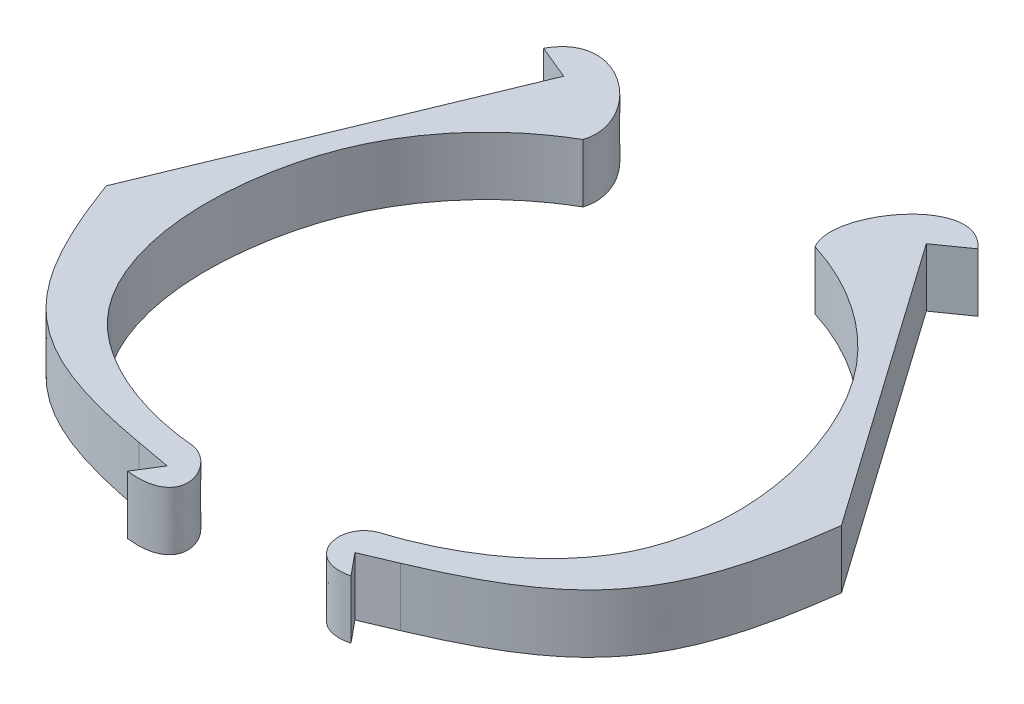
ISO-10303-21;
HEADER;
FILE_DESCRIPTION(('STEP AP214'),'2;1');
FILE_NAME('part.step','',(''),(''),'','','');
FILE_SCHEMA(('AUTOMOTIVE_DESIGN { 1 0 10303 214 1 1 1 1 }'));
ENDSEC;
DATA;
#1=APPLICATION_CONTEXT('core data for automotive mechanical design processes');
#2=APPLICATION_PROTOCOL_DEFINITION('international standard','automotive_design',2000,#1);
#3=PRODUCT_CONTEXT('',#1,'mechanical');
#4=PRODUCT('Part','Part','',(#3));
#5=PRODUCT_RELATED_PRODUCT_CATEGORY('part','',(#4));
#6=PRODUCT_DEFINITION_FORMATION('','',#4);
#7=PRODUCT_DEFINITION_CONTEXT('part definition',#1,'design');
#8=PRODUCT_DEFINITION('design','',#6,#7);
#9=PRODUCT_DEFINITION_SHAPE('','',#8);
#10=(LENGTH_UNIT() NAMED_UNIT(*) SI_UNIT(.MILLI.,.METRE.));
#11=(NAMED_UNIT(*) PLANE_ANGLE_UNIT() SI_UNIT($,.RADIAN.));
#12=(NAMED_UNIT(*) SI_UNIT($,.STERADIAN.) SOLID_ANGLE_UNIT());
#13=UNCERTAINTY_MEASURE_WITH_UNIT(LENGTH_MEASURE(1.E-05),#10,'distance_accuracy_value','');
#14=(GEOMETRIC_REPRESENTATION_CONTEXT(3) GLOBAL_UNCERTAINTY_ASSIGNED_CONTEXT((#13)) GLOBAL_UNIT_ASSIGNED_CONTEXT((#10,
#11,#12)) REPRESENTATION_CONTEXT('',''));
#15=CARTESIAN_POINT('',(0.,0.,0.));
#16=DIRECTION('',(0.,0.,1.));
#17=DIRECTION('',(1.,0.,0.));
#18=AXIS2_PLACEMENT_3D('',#15,#16,#17);
#19=CARTESIAN_POINT('',(13.3401271840576,10.,-42.9772149715773));
#20=CARTESIAN_POINT('',(18.1983826790333,10.,-41.4777573497734));
#21=CARTESIAN_POINT('',(26.0357979359804,10.,-37.466082022028));
#22=CARTESIAN_POINT('',(36.3860109344152,10.,-27.7090495551741));
#23=CARTESIAN_POINT('',(43.4874350538418,10.,-14.3700516680436));
#24=CARTESIAN_POINT('',(46.9928776558658,10.,1.8941735501374));
#25=CARTESIAN_POINT('',(43.2603036427735,10.,23.9310370366944));
#26=CARTESIAN_POINT('',(28.204878821677,10.,33.6317052501917));
#27=CARTESIAN_POINT('',(18.7515589170332,10.,36.6127100705704));
#28=B_SPLINE_CURVE_WITH_KNOTS('',3,(#19,#20,#21,#22,#23,#24,#25,#26,#27),.UNSPECIFIED.,.F.,.F.,
(4,1,1,1,1,1,4),(0.,0.143153018069429,0.245274505564908,0.396893762001973,0.561689325462741,
0.708961154458878,1.),.UNSPECIFIED.);
#29=DIRECTION('',(0.,-1.,0.));
#30=VECTOR('',#29,1.);
#31=SURFACE_OF_LINEAR_EXTRUSION('',#28,#30);
#32=CARTESIAN_POINT('',(13.3401271840576,0.,-42.9772149715773));
#33=CARTESIAN_POINT('',(18.1983826790333,0.,-41.4777573497734));
#34=CARTESIAN_POINT('',(26.0357979359804,0.,-37.466082022028));
#35=CARTESIAN_POINT('',(36.3860109344152,0.,-27.7090495551741));
#36=CARTESIAN_POINT('',(43.4874350538418,0.,-14.3700516680436));
#37=CARTESIAN_POINT('',(46.9928776558658,0.,1.8941735501374));
#38=CARTESIAN_POINT('',(43.2603036427735,0.,23.9310370366944));
#39=CARTESIAN_POINT('',(28.204878821677,0.,33.6317052501917));
#40=CARTESIAN_POINT('',(18.7515589170332,0.,36.6127100705704));
#41=B_SPLINE_CURVE_WITH_KNOTS('',3,(#32,#33,#34,#35,#36,#37,#38,#39,#40),.UNSPECIFIED.,.F.,.F.,
(4,1,1,1,1,1,4),(0.,0.143153018069429,0.245274505564908,0.396893762001973,0.561689325462741,
0.708961154458878,1.),.UNSPECIFIED.);
#42=CARTESIAN_POINT('',(13.3401271840576,0.,-42.9772149715773));
#43=VERTEX_POINT('',#42);
#44=CARTESIAN_POINT('',(18.7515589170332,0.,36.6127100705704));
#45=VERTEX_POINT('',#44);
#46=EDGE_CURVE('E12',#43,#45,#41,.T.);
#47=ORIENTED_EDGE('',*,*,#46,.T.);
#48=DIRECTION('',(0.,-1.,0.));
#49=VECTOR('',#48,1.);
#50=CARTESIAN_POINT('',(18.7515589170332,10.,36.6127100705704));
#51=LINE('',#50,#49);
#52=CARTESIAN_POINT('',(18.7515589170332,10.,36.6127100705704));
#53=VERTEX_POINT('',#52);
#54=EDGE_CURVE('E255',#53,#45,#51,.T.);
#55=ORIENTED_EDGE('',*,*,#54,.F.);
#56=CARTESIAN_POINT('',(13.3401271840576,10.,-42.9772149715773));
#57=VERTEX_POINT('',#56);
#58=EDGE_CURVE('E57',#57,#53,#28,.T.);
#59=ORIENTED_EDGE('',*,*,#58,.F.);
#60=DIRECTION('',(0.,-1.,0.));
#61=VECTOR('',#60,1.);
#62=CARTESIAN_POINT('',(13.3401271840576,10.,-42.9772149715773));
#63=LINE('',#62,#61);
#64=EDGE_CURVE('E175',#57,#43,#63,.T.);
#65=ORIENTED_EDGE('',*,*,#64,.T.);
#66=EDGE_LOOP('',(#47,#55,#59,#65));
#67=FACE_BOUND('',#66,.T.);
#68=ADVANCED_FACE('F53',(#67),#31,.F.);
#69=CARTESIAN_POINT('',(18.7515589170332,10.,36.6127100705704));
#70=CARTESIAN_POINT('',(13.113327903436,10.,38.3024500889482));
#71=CARTESIAN_POINT('',(15.3451705373407,10.,47.3805311045805));
#72=CARTESIAN_POINT('',(22.4040756837926,10.,45.5653840669214));
#73=B_SPLINE_CURVE_WITH_KNOTS('',3,(#69,#70,#71,#72),.UNSPECIFIED.,.F.,.F.,(4,4),(0.,1.),.UNSPECIFIED.);
#74=DIRECTION('',(0.,-1.,0.));
#75=VECTOR('',#74,1.);
#76=SURFACE_OF_LINEAR_EXTRUSION('',#73,#75);
#77=CARTESIAN_POINT('',(18.7515589170332,0.,36.6127100705704));
#78=CARTESIAN_POINT('',(13.113327903436,0.,38.3024500889482));
#79=CARTESIAN_POINT('',(15.3451705373407,0.,47.3805311045805));
#80=CARTESIAN_POINT('',(22.4040756837926,0.,45.5653840669214));
#81=B_SPLINE_CURVE_WITH_KNOTS('',3,(#77,#78,#79,#80),.UNSPECIFIED.,.F.,.F.,(4,4),(0.,1.),.UNSPECIFIED.);
#82=CARTESIAN_POINT('',(22.4040756837926,0.,45.5653840669214));
#83=VERTEX_POINT('',#82);
#84=EDGE_CURVE('E66',#45,#83,#81,.T.);
#85=ORIENTED_EDGE('',*,*,#84,.T.);
#86=DIRECTION('',(0.,-1.,0.));
#87=VECTOR('',#86,1.);
#88=CARTESIAN_POINT('',(22.4040756837926,10.,45.5653840669214));
#89=LINE('',#88,#87);
#90=CARTESIAN_POINT('',(22.4040756837926,10.,45.5653840669214));
#91=VERTEX_POINT('',#90);
#92=EDGE_CURVE('E136',#91,#83,#89,.T.);
#93=ORIENTED_EDGE('',*,*,#92,.F.);
#94=EDGE_CURVE('E102',#53,#91,#73,.T.);
#95=ORIENTED_EDGE('',*,*,#94,.F.);
#96=ORIENTED_EDGE('',*,*,#54,.T.);
#97=EDGE_LOOP('',(#85,#93,#95,#96));
#98=FACE_BOUND('',#97,.T.);
#99=ADVANCED_FACE('F191',(#98),#76,.F.);
#100=CARTESIAN_POINT('',(22.4040756837926,10.,45.5653840669214));
#101=DIRECTION('',(-0.772254750322428,0.,0.635312994203994));
#102=DIRECTION('',(0.635312994203994,0.,0.772254750322428));
#103=AXIS2_PLACEMENT_3D('',#100,#101,#102);
#104=PLANE('',#103);
#105=DIRECTION('',(-0.635312994203994,0.,-0.772254750322428));
#106=VECTOR('',#105,1.);
#107=CARTESIAN_POINT('',(22.4040756837926,0.,45.5653840669214));
#108=LINE('',#107,#106);
#109=CARTESIAN_POINT('',(19.2927642361893,0.,41.7834292398292));
#110=VERTEX_POINT('',#109);
#111=EDGE_CURVE('E130',#83,#110,#108,.T.);
#112=ORIENTED_EDGE('',*,*,#111,.T.);
#113=DIRECTION('',(0.,-1.,0.));
#114=VECTOR('',#113,1.);
#115=CARTESIAN_POINT('',(19.2927642361893,10.,41.7834292398292));
#116=LINE('',#115,#114);
#117=CARTESIAN_POINT('',(19.2927642361893,10.,41.7834292398292));
#118=VERTEX_POINT('',#117);
#119=EDGE_CURVE('E134',#118,#110,#116,.T.);
#120=ORIENTED_EDGE('',*,*,#119,.F.);
#121=DIRECTION('',(-0.635312994203994,0.,-0.772254750322428));
#122=VECTOR('',#121,1.);
#123=CARTESIAN_POINT('',(22.4040756837926,10.,45.5653840669214));
#124=LINE('',#123,#122);
#125=EDGE_CURVE('E204',#91,#118,#124,.T.);
#126=ORIENTED_EDGE('',*,*,#125,.F.);
#127=ORIENTED_EDGE('',*,*,#92,.T.);
#128=EDGE_LOOP('',(#112,#120,#126,#127));
#129=FACE_BOUND('',#128,.T.);
#130=ADVANCED_FACE('F132',(#129),#104,.F.);
#131=CARTESIAN_POINT('',(19.2927642361893,10.,41.7834292398292));
#132=DIRECTION('',(-0.390116820930196,0.,-0.920765369693777));
#133=DIRECTION('',(-0.920765369693777,0.,0.390116820930197));
#134=AXIS2_PLACEMENT_3D('',#131,#132,#133);
#135=PLANE('',#134);
#136=DIRECTION('',(0.920765369693777,0.,-0.390116820930196));
#137=VECTOR('',#136,1.);
#138=CARTESIAN_POINT('',(19.2927642361893,0.,41.7834292398292));
#139=LINE('',#138,#137);
#140=CARTESIAN_POINT('',(24.8026636857917,0.,39.4489534573193));
#141=VERTEX_POINT('',#140);
#142=EDGE_CURVE('E138',#110,#141,#139,.T.);
#143=ORIENTED_EDGE('',*,*,#142,.T.);
#144=DIRECTION('',(0.,-1.,0.));
#145=VECTOR('',#144,1.);
#146=CARTESIAN_POINT('',(24.8026636857917,10.,39.4489534573193));
#147=LINE('',#146,#145);
#148=CARTESIAN_POINT('',(24.8026636857917,10.,39.4489534573193));
#149=VERTEX_POINT('',#148);
#150=EDGE_CURVE('E145',#149,#141,#147,.T.);
#151=ORIENTED_EDGE('',*,*,#150,.F.);
#152=DIRECTION('',(0.920765369693777,0.,-0.390116820930196));
#153=VECTOR('',#152,1.);
#154=CARTESIAN_POINT('',(19.2927642361893,10.,41.7834292398292));
#155=LINE('',#154,#153);
#156=EDGE_CURVE('E144',#118,#149,#155,.T.);
#157=ORIENTED_EDGE('',*,*,#156,.F.);
#158=ORIENTED_EDGE('',*,*,#119,.T.);
#159=EDGE_LOOP('',(#143,#151,#157,#158));
#160=FACE_BOUND('',#159,.T.);
#161=ADVANCED_FACE('F141',(#160),#135,.F.);
#162=CARTESIAN_POINT('',(24.8026636857917,10.,39.4489534573193));
#163=CARTESIAN_POINT('',(47.202309680957,10.,29.9585023899622));
#164=CARTESIAN_POINT('',(53.5973309696413,10.,21.2672439048042));
#165=CARTESIAN_POINT('',(56.937828510635,10.,-3.89589383247926));
#166=B_SPLINE_CURVE_WITH_KNOTS('',3,(#162,#163,#164,#165),.UNSPECIFIED.,.F.,.F.,(4,4),(0.,1.),.UNSPECIFIED.);
#167=DIRECTION('',(0.,-1.,0.));
#168=VECTOR('',#167,1.);
#169=SURFACE_OF_LINEAR_EXTRUSION('',#166,#168);
#170=CARTESIAN_POINT('',(24.8026636857917,0.,39.4489534573193));
#171=CARTESIAN_POINT('',(47.202309680957,0.,29.9585023899622));
#172=CARTESIAN_POINT('',(53.5973309696413,0.,21.2672439048042));
#173=CARTESIAN_POINT('',(56.937828510635,0.,-3.89589383247926));
#174=B_SPLINE_CURVE_WITH_KNOTS('',3,(#170,#171,#172,#173),.UNSPECIFIED.,.F.,.F.,(4,4),(0.,1.),.UNSPECIFIED.);
#175=CARTESIAN_POINT('',(56.937828510635,0.,-3.89589383247926));
#176=VERTEX_POINT('',#175);
#177=EDGE_CURVE('E150',#141,#176,#174,.T.);
#178=ORIENTED_EDGE('',*,*,#177,.T.);
#179=DIRECTION('',(0.,-1.,0.));
#180=VECTOR('',#179,1.);
#181=CARTESIAN_POINT('',(56.937828510635,10.,-3.89589383247926));
#182=LINE('',#181,#180);
#183=CARTESIAN_POINT('',(56.937828510635,10.,-3.89589383247926));
#184=VERTEX_POINT('',#183);
#185=EDGE_CURVE('E236',#184,#176,#182,.T.);
#186=ORIENTED_EDGE('',*,*,#185,.F.);
#187=EDGE_CURVE('E210',#149,#184,#166,.T.);
#188=ORIENTED_EDGE('',*,*,#187,.F.);
#189=ORIENTED_EDGE('',*,*,#150,.T.);
#190=EDGE_LOOP('',(#178,#186,#188,#189));
#191=FACE_BOUND('',#190,.T.);
#192=ADVANCED_FACE('F219',(#191),#169,.F.);
#193=CARTESIAN_POINT('',(22.4040756837926,10.,-52.961359444196));
#194=DIRECTION('',(-0.817757760195279,0.,0.57556254711404));
#195=DIRECTION('',(0.57556254711404,0.,0.817757760195278));
#196=AXIS2_PLACEMENT_3D('',#193,#194,#195);
#197=PLANE('',#196);
#198=DIRECTION('',(-0.57556254711404,0.,-0.817757760195279));
#199=VECTOR('',#198,1.);
#200=CARTESIAN_POINT('',(22.4040756837926,0.,-52.961359444196));
#201=LINE('',#200,#199);
#202=CARTESIAN_POINT('',(22.4040756837926,0.,-52.961359444196));
#203=VERTEX_POINT('',#202);
#204=EDGE_CURVE('E152',#176,#203,#201,.T.);
#205=ORIENTED_EDGE('',*,*,#204,.T.);
#206=DIRECTION('',(0.,-1.,0.));
#207=VECTOR('',#206,1.);
#208=CARTESIAN_POINT('',(22.4040756837926,10.,-52.961359444196));
#209=LINE('',#208,#207);
#210=CARTESIAN_POINT('',(22.4040756837926,10.,-52.961359444196));
#211=VERTEX_POINT('',#210);
#212=EDGE_CURVE('E233',#211,#203,#209,.T.);
#213=ORIENTED_EDGE('',*,*,#212,.F.);
#214=DIRECTION('',(-0.57556254711404,0.,-0.817757760195279));
#215=VECTOR('',#214,1.);
#216=CARTESIAN_POINT('',(22.4040756837926,10.,-52.961359444196));
#217=LINE('',#216,#215);
#218=EDGE_CURVE('E214',#184,#211,#217,.T.);
#219=ORIENTED_EDGE('',*,*,#218,.F.);
#220=ORIENTED_EDGE('',*,*,#185,.T.);
#221=EDGE_LOOP('',(#205,#213,#219,#220));
#222=FACE_BOUND('',#221,.T.);
#223=ADVANCED_FACE('F221',(#222),#197,.F.);
#224=CARTESIAN_POINT('',(27.5882649795613,10.,-56.6101480476589));
#225=DIRECTION('',(-0.575562547114036,0.,-0.817757760195282));
#226=DIRECTION('',(-0.817757760195282,0.,0.575562547114035));
#227=AXIS2_PLACEMENT_3D('',#224,#225,#226);
#228=PLANE('',#227);
#229=DIRECTION('',(0.817757760195282,0.,-0.575562547114036));
#230=VECTOR('',#229,1.);
#231=CARTESIAN_POINT('',(27.5882649795613,0.,-56.6101480476589));
#232=LINE('',#231,#230);
#233=CARTESIAN_POINT('',(27.5882649795613,0.,-56.6101480476589));
#234=VERTEX_POINT('',#233);
#235=EDGE_CURVE('E238',#203,#234,#232,.T.);
#236=ORIENTED_EDGE('',*,*,#235,.T.);
#237=DIRECTION('',(0.,-1.,0.));
#238=VECTOR('',#237,1.);
#239=CARTESIAN_POINT('',(27.5882649795613,10.,-56.6101480476589));
#240=LINE('',#239,#238);
#241=CARTESIAN_POINT('',(27.5882649795613,10.,-56.6101480476589));
#242=VERTEX_POINT('',#241);
#243=EDGE_CURVE('E240',#242,#234,#240,.T.);
#244=ORIENTED_EDGE('',*,*,#243,.F.);
#245=DIRECTION('',(0.817757760195282,0.,-0.575562547114036));
#246=VECTOR('',#245,1.);
#247=CARTESIAN_POINT('',(27.5882649795613,10.,-56.6101480476589));
#248=LINE('',#247,#246);
#249=EDGE_CURVE('E174',#211,#242,#248,.T.);
#250=ORIENTED_EDGE('',*,*,#249,.F.);
#251=ORIENTED_EDGE('',*,*,#212,.T.);
#252=EDGE_LOOP('',(#236,#244,#250,#251));
#253=FACE_BOUND('',#252,.T.);
#254=ADVANCED_FACE('F184',(#253),#228,.F.);
#255=CARTESIAN_POINT('',(27.5882649795613,10.,-56.6101480476589));
#256=CARTESIAN_POINT('',(20.3814538565295,10.,-64.8803039396855));
#257=CARTESIAN_POINT('',(9.17623482386253,10.,-49.8982403780272));
#258=CARTESIAN_POINT('',(13.3401271840576,10.,-42.9772149715773));
#259=B_SPLINE_CURVE_WITH_KNOTS('',3,(#255,#256,#257,#258),.UNSPECIFIED.,.F.,.F.,(4,4),(0.,1.),.UNSPECIFIED.);
#260=DIRECTION('',(0.,-1.,0.));
#261=VECTOR('',#260,1.);
#262=SURFACE_OF_LINEAR_EXTRUSION('',#259,#261);
#263=CARTESIAN_POINT('',(27.5882649795613,0.,-56.6101480476589));
#264=CARTESIAN_POINT('',(20.3814538565295,0.,-64.8803039396855));
#265=CARTESIAN_POINT('',(9.17623482386253,0.,-49.8982403780272));
#266=CARTESIAN_POINT('',(13.3401271840576,0.,-42.9772149715773));
#267=B_SPLINE_CURVE_WITH_KNOTS('',3,(#263,#264,#265,#266),.UNSPECIFIED.,.F.,.F.,(4,4),(0.,1.),.UNSPECIFIED.);
#268=EDGE_CURVE('E113',#234,#43,#267,.T.);
#269=ORIENTED_EDGE('',*,*,#268,.T.);
#270=ORIENTED_EDGE('',*,*,#64,.F.);
#271=EDGE_CURVE('E166',#242,#57,#259,.T.);
#272=ORIENTED_EDGE('',*,*,#271,.F.);
#273=ORIENTED_EDGE('',*,*,#243,.T.);
#274=EDGE_LOOP('',(#269,#270,#272,#273));
#275=FACE_BOUND('',#274,.T.);
#276=ADVANCED_FACE('F181',(#275),#262,.F.);
#277=CARTESIAN_POINT('',(45.3908590733236,10.,-3.93697697333965));
#278=DIRECTION('',(0.,1.,0.));
#279=DIRECTION('',(0.,0.,1.));
#280=AXIS2_PLACEMENT_3D('',#277,#278,#279);
#281=PLANE('',#280);
#282=ORIENTED_EDGE('',*,*,#58,.T.);
#283=ORIENTED_EDGE('',*,*,#94,.T.);
#284=ORIENTED_EDGE('',*,*,#125,.T.);
#285=ORIENTED_EDGE('',*,*,#156,.T.);
#286=ORIENTED_EDGE('',*,*,#187,.T.);
#287=ORIENTED_EDGE('',*,*,#218,.T.);
#288=ORIENTED_EDGE('',*,*,#249,.T.);
#289=ORIENTED_EDGE('',*,*,#271,.T.);
#290=EDGE_LOOP('',(#282,#283,#284,#285,#286,#287,#288,#289));
#291=FACE_BOUND('',#290,.T.);
#292=ADVANCED_FACE('F55',(#291),#281,.T.);
#293=CARTESIAN_POINT('',(45.3908590733236,0.,-3.93697697333965));
#294=DIRECTION('',(0.,1.,0.));
#295=DIRECTION('',(0.,0.,1.));
#296=AXIS2_PLACEMENT_3D('',#293,#294,#295);
#297=PLANE('',#296);
#298=ORIENTED_EDGE('',*,*,#46,.F.);
#299=ORIENTED_EDGE('',*,*,#268,.F.);
#300=ORIENTED_EDGE('',*,*,#235,.F.);
#301=ORIENTED_EDGE('',*,*,#204,.F.);
#302=ORIENTED_EDGE('',*,*,#177,.F.);
#303=ORIENTED_EDGE('',*,*,#142,.F.);
#304=ORIENTED_EDGE('',*,*,#111,.F.);
#305=ORIENTED_EDGE('',*,*,#84,.F.);
#306=EDGE_LOOP('',(#298,#299,#300,#301,#302,#303,#304,#305));
#307=FACE_BOUND('',#306,.T.);
#308=ADVANCED_FACE('F148',(#307),#297,.F.);
#309=CLOSED_SHELL('',(#68,#99,#130,#161,#192,#223,#254,#276,#292,#308));
#310=MANIFOLD_SOLID_BREP('B2',#309);
#311=CARTESIAN_POINT('',(-22.4515367160708,10.,-38.9990833108539));
#312=CARTESIAN_POINT('',(-19.9089938805198,10.,-46.6655080442876));
#313=CARTESIAN_POINT('',(-34.1305195103821,10.,-58.821468347562));
#314=CARTESIAN_POINT('',(-39.3454727767035,10.,-49.1706721383594));
#315=B_SPLINE_CURVE_WITH_KNOTS('',3,(#311,#312,#313,#314),.UNSPECIFIED.,.F.,.F.,(4,4),(0.,1.),.UNSPECIFIED.);
#316=DIRECTION('',(0.,-1.,0.));
#317=VECTOR('',#316,1.);
#318=SURFACE_OF_LINEAR_EXTRUSION('',#315,#317);
#319=CARTESIAN_POINT('',(-22.4515367160708,0.,-38.9990833108539));
#320=CARTESIAN_POINT('',(-19.9089938805198,0.,-46.6655080442876));
#321=CARTESIAN_POINT('',(-34.1305195103821,0.,-58.821468347562));
#322=CARTESIAN_POINT('',(-39.3454727767035,0.,-49.1706721383594));
#323=B_SPLINE_CURVE_WITH_KNOTS('',3,(#319,#320,#321,#322),.UNSPECIFIED.,.F.,.F.,(4,4),(0.,1.),.UNSPECIFIED.);
#324=CARTESIAN_POINT('',(-22.4515367160708,0.,-38.9990833108539));
#325=VERTEX_POINT('',#324);
#326=CARTESIAN_POINT('',(-39.3454727767035,0.,-49.1706721383594));
#327=VERTEX_POINT('',#326);
#328=EDGE_CURVE('E508',#325,#327,#323,.T.);
#329=ORIENTED_EDGE('',*,*,#328,.T.);
#330=DIRECTION('',(0.,-1.,0.));
#331=VECTOR('',#330,1.);
#332=CARTESIAN_POINT('',(-39.3454727767035,10.,-49.1706721383594));
#333=LINE('',#332,#331);
#334=CARTESIAN_POINT('',(-39.3454727767035,10.,-49.1706721383594));
#335=VERTEX_POINT('',#334);
#336=EDGE_CURVE('E51',#335,#327,#333,.T.);
#337=ORIENTED_EDGE('',*,*,#336,.F.);
#338=CARTESIAN_POINT('',(-22.4515367160708,10.,-38.9990833108539));
#339=VERTEX_POINT('',#338);
#340=EDGE_CURVE('E489',#339,#335,#315,.T.);
#341=ORIENTED_EDGE('',*,*,#340,.F.);
#342=DIRECTION('',(0.,-1.,0.));
#343=VECTOR('',#342,1.);
#344=CARTESIAN_POINT('',(-22.4515367160708,10.,-38.9990833108539));
#345=LINE('',#344,#343);
#346=EDGE_CURVE('E443',#339,#325,#345,.T.);
#347=ORIENTED_EDGE('',*,*,#346,.T.);
#348=EDGE_LOOP('',(#329,#337,#341,#347));
#349=FACE_BOUND('',#348,.T.);
#350=ADVANCED_FACE('F345',(#349),#318,.F.);
#351=CARTESIAN_POINT('',(-39.3454727767035,10.,-49.1706721383594));
#352=DIRECTION('',(0.381951334412585,0.,-0.924182437693146));
#353=DIRECTION('',(-0.924182437693146,0.,-0.381951334412585));
#354=AXIS2_PLACEMENT_3D('',#351,#352,#353);
#355=PLANE('',#354);
#356=DIRECTION('',(0.924182437693146,0.,0.381951334412585));
#357=VECTOR('',#356,1.);
#358=CARTESIAN_POINT('',(-39.3454727767035,0.,-49.1706721383594));
#359=LINE('',#358,#357);
#360=CARTESIAN_POINT('',(-33.4866024192005,0.,-46.7492851265217));
#361=VERTEX_POINT('',#360);
#362=EDGE_CURVE('E505',#327,#361,#359,.T.);
#363=ORIENTED_EDGE('',*,*,#362,.T.);
#364=DIRECTION('',(0.,-1.,0.));
#365=VECTOR('',#364,1.);
#366=CARTESIAN_POINT('',(-33.4866024192005,10.,-46.7492851265217));
#367=LINE('',#366,#365);
#368=CARTESIAN_POINT('',(-33.4866024192005,10.,-46.7492851265217));
#369=VERTEX_POINT('',#368);
#370=EDGE_CURVE('E355',#369,#361,#367,.T.);
#371=ORIENTED_EDGE('',*,*,#370,.F.);
#372=DIRECTION('',(0.924182437693146,0.,0.381951334412585));
#373=VECTOR('',#372,1.);
#374=CARTESIAN_POINT('',(-39.3454727767035,10.,-49.1706721383594));
#375=LINE('',#374,#373);
#376=EDGE_CURVE('E406',#335,#369,#375,.T.);
#377=ORIENTED_EDGE('',*,*,#376,.F.);
#378=ORIENTED_EDGE('',*,*,#336,.T.);
#379=EDGE_LOOP('',(#363,#371,#377,#378));
#380=FACE_BOUND('',#379,.T.);
#381=ADVANCED_FACE('F561',(#380),#355,.F.);
#382=CARTESIAN_POINT('',(-33.4866024192005,10.,-46.7492851265217));
#383=DIRECTION('',(0.924182437693145,0.,0.381951334412587));
#384=DIRECTION('',(0.381951334412587,0.,-0.924182437693145));
#385=AXIS2_PLACEMENT_3D('',#382,#383,#384);
#386=PLANE('',#385);
#387=DIRECTION('',(-0.381951334412587,0.,0.924182437693145));
#388=VECTOR('',#387,1.);
#389=CARTESIAN_POINT('',(-33.4866024192005,0.,-46.7492851265217));
#390=LINE('',#389,#388);
#391=CARTESIAN_POINT('',(-56.4036824839557,0.,8.70166113506698));
#392=VERTEX_POINT('',#391);
#393=EDGE_CURVE('E502',#361,#392,#390,.T.);
#394=ORIENTED_EDGE('',*,*,#393,.T.);
#395=DIRECTION('',(0.,-1.,0.));
#396=VECTOR('',#395,1.);
#397=CARTESIAN_POINT('',(-56.4036824839557,10.,8.70166113506698));
#398=LINE('',#397,#396);
#399=CARTESIAN_POINT('',(-56.4036824839557,10.,8.70166113506698));
#400=VERTEX_POINT('',#399);
#401=EDGE_CURVE('E545',#400,#392,#398,.T.);
#402=ORIENTED_EDGE('',*,*,#401,.F.);
#403=DIRECTION('',(-0.381951334412587,0.,0.924182437693145));
#404=VECTOR('',#403,1.);
#405=CARTESIAN_POINT('',(-33.4866024192005,10.,-46.7492851265217));
#406=LINE('',#405,#404);
#407=EDGE_CURVE('E480',#369,#400,#406,.T.);
#408=ORIENTED_EDGE('',*,*,#407,.F.);
#409=ORIENTED_EDGE('',*,*,#370,.T.);
#410=EDGE_LOOP('',(#394,#402,#408,#409));
#411=FACE_BOUND('',#410,.T.);
#412=ADVANCED_FACE('F472',(#411),#386,.F.);
#413=CARTESIAN_POINT('',(-56.4036824839557,10.,8.70166113506698));
#414=CARTESIAN_POINT('',(-47.6193620923331,10.,32.5171632264404));
#415=CARTESIAN_POINT('',(-39.4719797779607,10.,39.5920789688367));
#416=CARTESIAN_POINT('',(-15.5350901255131,10.,43.932368813671));
#417=B_SPLINE_CURVE_WITH_KNOTS('',3,(#413,#414,#415,#416),.UNSPECIFIED.,.F.,.F.,(4,4),(0.,1.),.UNSPECIFIED.);
#418=DIRECTION('',(0.,-1.,0.));
#419=VECTOR('',#418,1.);
#420=SURFACE_OF_LINEAR_EXTRUSION('',#417,#419);
#421=CARTESIAN_POINT('',(-56.4036824839557,0.,8.70166113506698));
#422=CARTESIAN_POINT('',(-47.6193620923331,0.,32.5171632264404));
#423=CARTESIAN_POINT('',(-39.4719797779607,0.,39.5920789688367));
#424=CARTESIAN_POINT('',(-15.5350901255131,0.,43.932368813671));
#425=B_SPLINE_CURVE_WITH_KNOTS('',3,(#421,#422,#423,#424),.UNSPECIFIED.,.F.,.F.,(4,4),(0.,1.),.UNSPECIFIED.);
#426=CARTESIAN_POINT('',(-15.5350901255131,0.,43.932368813671));
#427=VERTEX_POINT('',#426);
#428=EDGE_CURVE('E499',#392,#427,#425,.T.);
#429=ORIENTED_EDGE('',*,*,#428,.T.);
#430=DIRECTION('',(0.,-1.,0.));
#431=VECTOR('',#430,1.);
#432=CARTESIAN_POINT('',(-15.5350901255131,10.,43.932368813671));
#433=LINE('',#432,#431);
#434=CARTESIAN_POINT('',(-15.5350901255131,10.,43.932368813671));
#435=VERTEX_POINT('',#434);
#436=EDGE_CURVE('E541',#435,#427,#433,.T.);
#437=ORIENTED_EDGE('',*,*,#436,.F.);
#438=EDGE_CURVE('E474',#400,#435,#417,.T.);
#439=ORIENTED_EDGE('',*,*,#438,.F.);
#440=ORIENTED_EDGE('',*,*,#401,.T.);
#441=EDGE_LOOP('',(#429,#437,#439,#440));
#442=FACE_BOUND('',#441,.T.);
#443=ADVANCED_FACE('F467',(#442),#420,.F.);
#444=CARTESIAN_POINT('',(-9.6470571115235,10.,45.));
#445=DIRECTION('',(0.178413024224562,0.,-0.983955686393979));
#446=DIRECTION('',(-0.983955686393979,0.,-0.178413024224562));
#447=AXIS2_PLACEMENT_3D('',#444,#445,#446);
#448=PLANE('',#447);
#449=DIRECTION('',(0.983955686393979,0.,0.178413024224563));
#450=VECTOR('',#449,1.);
#451=CARTESIAN_POINT('',(-9.6470571115235,0.,45.));
#452=LINE('',#451,#450);
#453=CARTESIAN_POINT('',(-9.6470571115235,0.,45.));
#454=VERTEX_POINT('',#453);
#455=EDGE_CURVE('E496',#427,#454,#452,.T.);
#456=ORIENTED_EDGE('',*,*,#455,.T.);
#457=DIRECTION('',(0.,-1.,0.));
#458=VECTOR('',#457,1.);
#459=CARTESIAN_POINT('',(-9.6470571115235,10.,45.));
#460=LINE('',#459,#458);
#461=CARTESIAN_POINT('',(-9.6470571115235,10.,45.));
#462=VERTEX_POINT('',#461);
#463=EDGE_CURVE('E436',#462,#454,#460,.T.);
#464=ORIENTED_EDGE('',*,*,#463,.F.);
#465=DIRECTION('',(0.983955686393979,0.,0.178413024224563));
#466=VECTOR('',#465,1.);
#467=CARTESIAN_POINT('',(-9.6470571115235,10.,45.));
#468=LINE('',#467,#466);
#469=EDGE_CURVE('E425',#435,#462,#468,.T.);
#470=ORIENTED_EDGE('',*,*,#469,.F.);
#471=ORIENTED_EDGE('',*,*,#436,.T.);
#472=EDGE_LOOP('',(#456,#464,#470,#471));
#473=FACE_BOUND('',#472,.T.);
#474=ADVANCED_FACE('F464',(#473),#448,.F.);
#475=CARTESIAN_POINT('',(-12.2614519720141,10.,49.1812057398369));
#476=DIRECTION('',(0.847894271775221,0.,0.530165355234353));
#477=DIRECTION('',(0.530165355234353,0.,-0.847894271775221));
#478=AXIS2_PLACEMENT_3D('',#475,#476,#477);
#479=PLANE('',#478);
#480=DIRECTION('',(-0.530165355234353,0.,0.847894271775221));
#481=VECTOR('',#480,1.);
#482=CARTESIAN_POINT('',(-12.2614519720141,0.,49.1812057398369));
#483=LINE('',#482,#481);
#484=CARTESIAN_POINT('',(-12.2614519720141,0.,49.1812057398369));
#485=VERTEX_POINT('',#484);
#486=EDGE_CURVE('E434',#454,#485,#483,.T.);
#487=ORIENTED_EDGE('',*,*,#486,.T.);
#488=DIRECTION('',(0.,-1.,0.));
#489=VECTOR('',#488,1.);
#490=CARTESIAN_POINT('',(-12.2614519720141,10.,49.1812057398369));
#491=LINE('',#490,#489);
#492=CARTESIAN_POINT('',(-12.2614519720141,10.,49.1812057398369));
#493=VERTEX_POINT('',#492);
#494=EDGE_CURVE('E431',#493,#485,#491,.T.);
#495=ORIENTED_EDGE('',*,*,#494,.F.);
#496=DIRECTION('',(-0.530165355234353,0.,0.847894271775221));
#497=VECTOR('',#496,1.);
#498=CARTESIAN_POINT('',(-12.2614519720141,10.,49.1812057398369));
#499=LINE('',#498,#497);
#500=EDGE_CURVE('E419',#462,#493,#499,.T.);
#501=ORIENTED_EDGE('',*,*,#500,.F.);
#502=ORIENTED_EDGE('',*,*,#463,.T.);
#503=EDGE_LOOP('',(#487,#495,#501,#502));
#504=FACE_BOUND('',#503,.T.);
#505=ADVANCED_FACE('F432',(#504),#479,.F.);
#506=CARTESIAN_POINT('',(-12.2614519720141,10.,49.1812057398369));
#507=CARTESIAN_POINT('',(-1.69430047775634,10.,50.4188000589842));
#508=CARTESIAN_POINT('',(-5.19946162714382,10.,41.0134764866711));
#509=CARTESIAN_POINT('',(-10.2544526764188,10.,39.8366376698348));
#510=B_SPLINE_CURVE_WITH_KNOTS('',3,(#506,#507,#508,#509),.UNSPECIFIED.,.F.,.F.,(4,4),(0.,1.),.UNSPECIFIED.);
#511=DIRECTION('',(0.,-1.,0.));
#512=VECTOR('',#511,1.);
#513=SURFACE_OF_LINEAR_EXTRUSION('',#510,#512);
#514=CARTESIAN_POINT('',(-12.2614519720141,0.,49.1812057398369));
#515=CARTESIAN_POINT('',(-1.69430047775634,0.,50.4188000589842));
#516=CARTESIAN_POINT('',(-5.19946162714382,0.,41.0134764866711));
#517=CARTESIAN_POINT('',(-10.2544526764188,0.,39.8366376698348));
#518=B_SPLINE_CURVE_WITH_KNOTS('',3,(#514,#515,#516,#517),.UNSPECIFIED.,.F.,.F.,(4,4),(0.,1.),.UNSPECIFIED.);
#519=CARTESIAN_POINT('',(-10.2544526764188,0.,39.8366376698348));
#520=VERTEX_POINT('',#519);
#521=EDGE_CURVE('E392',#485,#520,#518,.T.);
#522=ORIENTED_EDGE('',*,*,#521,.T.);
#523=DIRECTION('',(0.,-1.,0.));
#524=VECTOR('',#523,1.);
#525=CARTESIAN_POINT('',(-10.2544526764188,10.,39.8366376698348));
#526=LINE('',#525,#524);
#527=CARTESIAN_POINT('',(-10.2544526764188,10.,39.8366376698348));
#528=VERTEX_POINT('',#527);
#529=EDGE_CURVE('E437',#528,#520,#526,.T.);
#530=ORIENTED_EDGE('',*,*,#529,.F.);
#531=EDGE_CURVE('E423',#493,#528,#510,.T.);
#532=ORIENTED_EDGE('',*,*,#531,.F.);
#533=ORIENTED_EDGE('',*,*,#494,.T.);
#534=EDGE_LOOP('',(#522,#530,#532,#533));
#535=FACE_BOUND('',#534,.T.);
#536=ADVANCED_FACE('F439',(#535),#513,.F.);
#537=CARTESIAN_POINT('',(-10.2544526764188,10.,39.8366376698348));
#538=CARTESIAN_POINT('',(-20.1316295615174,10.,39.004157196113));
#539=CARTESIAN_POINT('',(-36.9496990345085,10.,32.8461283285541));
#540=CARTESIAN_POINT('',(-45.4300561422028,10.,12.1666939935839));
#541=CARTESIAN_POINT('',(-45.5814834735852,10.,-4.47031954692588));
#542=CARTESIAN_POINT('',(-41.5823672148887,10.,-19.0431078287297));
#543=CARTESIAN_POINT('',(-33.6272192135866,10.,-30.8347240008066));
#544=CARTESIAN_POINT('',(-26.8619702096692,10.,-36.4694398552276));
#545=CARTESIAN_POINT('',(-22.4515367160708,10.,-38.9990833108539));
#546=B_SPLINE_CURVE_WITH_KNOTS('',3,(#537,#538,#539,#540,#541,#542,#543,#544,#545),
.UNSPECIFIED.,.F.,.F.,(4,1,1,1,1,1,4),(0.,0.291038845541122,0.438310674537259,0.603106237998027,
0.754725494435092,0.856846981930571,1.),.UNSPECIFIED.);
#547=DIRECTION('',(0.,-1.,0.));
#548=VECTOR('',#547,1.);
#549=SURFACE_OF_LINEAR_EXTRUSION('',#546,#548);
#550=CARTESIAN_POINT('',(-10.2544526764188,0.,39.8366376698348));
#551=CARTESIAN_POINT('',(-20.1316295615174,0.,39.004157196113));
#552=CARTESIAN_POINT('',(-36.9496990345085,0.,32.8461283285541));
#553=CARTESIAN_POINT('',(-45.4300561422028,0.,12.1666939935839));
#554=CARTESIAN_POINT('',(-45.5814834735852,0.,-4.47031954692588));
#555=CARTESIAN_POINT('',(-41.5823672148887,0.,-19.0431078287297));
#556=CARTESIAN_POINT('',(-33.6272192135866,0.,-30.8347240008066));
#557=CARTESIAN_POINT('',(-26.8619702096692,0.,-36.4694398552276));
#558=CARTESIAN_POINT('',(-22.4515367160708,0.,-38.9990833108539));
#559=B_SPLINE_CURVE_WITH_KNOTS('',3,(#550,#551,#552,#553,#554,#555,#556,#557,#558),
.UNSPECIFIED.,.F.,.F.,(4,1,1,1,1,1,4),(0.,0.291038845541122,0.438310674537259,0.603106237998027,
0.754725494435092,0.856846981930571,1.),.UNSPECIFIED.);
#560=EDGE_CURVE('E398',#520,#325,#559,.T.);
#561=ORIENTED_EDGE('',*,*,#560,.T.);
#562=ORIENTED_EDGE('',*,*,#346,.F.);
#563=EDGE_CURVE('E363',#528,#339,#546,.T.);
#564=ORIENTED_EDGE('',*,*,#563,.F.);
#565=ORIENTED_EDGE('',*,*,#529,.T.);
#566=EDGE_LOOP('',(#561,#562,#564,#565));
#567=FACE_BOUND('',#566,.T.);
#568=ADVANCED_FACE('F460',(#567),#549,.F.);
#569=CARTESIAN_POINT('',(-27.989443708185,10.,-50.5788355780953));
#570=DIRECTION('',(0.,-1.,0.));
#571=DIRECTION('',(0.,0.,-1.));
#572=AXIS2_PLACEMENT_3D('',#569,#570,#571);
#573=PLANE('',#572);
#574=ORIENTED_EDGE('',*,*,#340,.T.);
#575=ORIENTED_EDGE('',*,*,#376,.T.);
#576=ORIENTED_EDGE('',*,*,#407,.T.);
#577=ORIENTED_EDGE('',*,*,#438,.T.);
#578=ORIENTED_EDGE('',*,*,#469,.T.);
#579=ORIENTED_EDGE('',*,*,#500,.T.);
#580=ORIENTED_EDGE('',*,*,#531,.T.);
#581=ORIENTED_EDGE('',*,*,#563,.T.);
#582=EDGE_LOOP('',(#574,#575,#576,#577,#578,#579,#580,#581));
#583=FACE_BOUND('',#582,.T.);
#584=ADVANCED_FACE('F421',(#583),#573,.F.);
#585=CARTESIAN_POINT('',(-27.989443708185,0.,-50.5788355780953));
#586=DIRECTION('',(0.,-1.,0.));
#587=DIRECTION('',(0.,0.,-1.));
#588=AXIS2_PLACEMENT_3D('',#585,#586,#587);
#589=PLANE('',#588);
#590=ORIENTED_EDGE('',*,*,#328,.F.);
#591=ORIENTED_EDGE('',*,*,#560,.F.);
#592=ORIENTED_EDGE('',*,*,#521,.F.);
#593=ORIENTED_EDGE('',*,*,#486,.F.);
#594=ORIENTED_EDGE('',*,*,#455,.F.);
#595=ORIENTED_EDGE('',*,*,#428,.F.);
#596=ORIENTED_EDGE('',*,*,#393,.F.);
#597=ORIENTED_EDGE('',*,*,#362,.F.);
#598=EDGE_LOOP('',(#590,#591,#592,#593,#594,#595,#596,#597));
#599=FACE_BOUND('',#598,.T.);
#600=ADVANCED_FACE('F556',(#599),#589,.T.);
#601=CLOSED_SHELL('',(#350,#381,#412,#443,#474,#505,#536,#568,#584,#600));
#602=MANIFOLD_SOLID_BREP('B6',#601);
#603=ADVANCED_BREP_SHAPE_REPRESENTATION('',(#18,#310,#602),#14);
#604=SHAPE_DEFINITION_REPRESENTATION(#9,#603);
ENDSEC;
END-ISO-10303-21;
